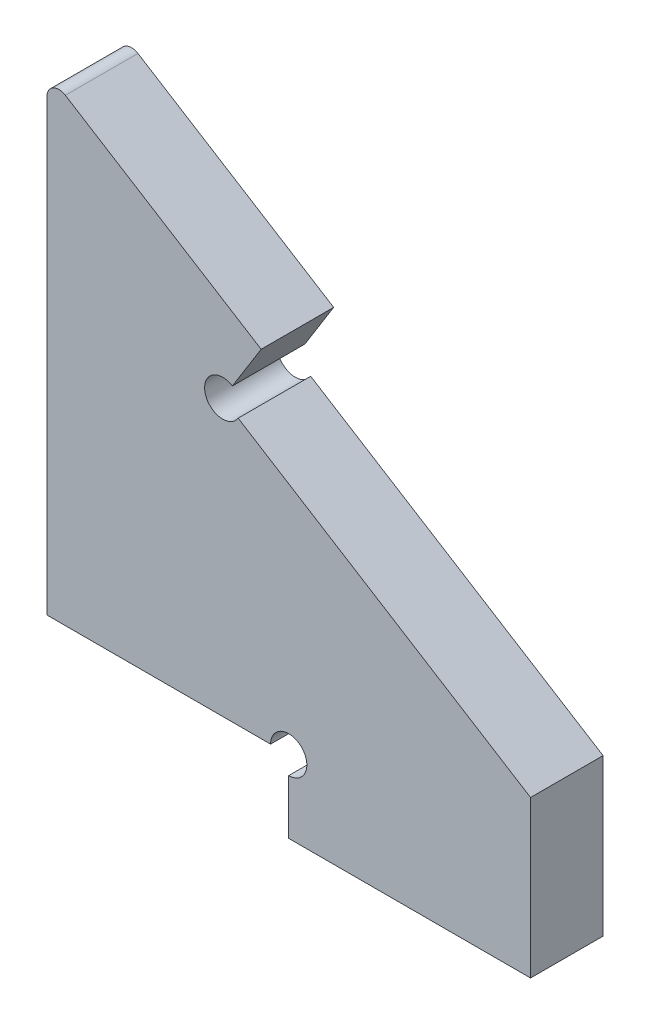
ISO-10303-21;
HEADER;
FILE_DESCRIPTION(('STEP AP214'),'2;1');
FILE_NAME('part.step','',(''),(''),'','','');
FILE_SCHEMA(('AUTOMOTIVE_DESIGN { 1 0 10303 214 1 1 1 1 }'));
ENDSEC;
DATA;
#1=APPLICATION_CONTEXT('core data for automotive mechanical design processes');
#2=APPLICATION_PROTOCOL_DEFINITION('international standard','automotive_design',2000,#1);
#3=PRODUCT_CONTEXT('',#1,'mechanical');
#4=PRODUCT('Part','Part','',(#3));
#5=PRODUCT_RELATED_PRODUCT_CATEGORY('part','',(#4));
#6=PRODUCT_DEFINITION_FORMATION('','',#4);
#7=PRODUCT_DEFINITION_CONTEXT('part definition',#1,'design');
#8=PRODUCT_DEFINITION('design','',#6,#7);
#9=PRODUCT_DEFINITION_SHAPE('','',#8);
#10=(LENGTH_UNIT() NAMED_UNIT(*) SI_UNIT(.MILLI.,.METRE.));
#11=(NAMED_UNIT(*) PLANE_ANGLE_UNIT() SI_UNIT($,.RADIAN.));
#12=(NAMED_UNIT(*) SI_UNIT($,.STERADIAN.) SOLID_ANGLE_UNIT());
#13=UNCERTAINTY_MEASURE_WITH_UNIT(LENGTH_MEASURE(1.E-05),#10,'distance_accuracy_value','');
#14=(GEOMETRIC_REPRESENTATION_CONTEXT(3) GLOBAL_UNCERTAINTY_ASSIGNED_CONTEXT((#13)) GLOBAL_UNIT_ASSIGNED_CONTEXT((#10,
#11,#12)) REPRESENTATION_CONTEXT('',''));
#15=CARTESIAN_POINT('',(0.,0.,0.));
#16=DIRECTION('',(0.,0.,1.));
#17=DIRECTION('',(1.,0.,0.));
#18=AXIS2_PLACEMENT_3D('',#15,#16,#17);
#19=CARTESIAN_POINT('',(0.,0.,3.));
#20=DIRECTION('',(0.,0.,-1.));
#21=DIRECTION('',(-1.,0.,0.));
#22=AXIS2_PLACEMENT_3D('',#19,#20,#21);
#23=PLANE('',#22);
#24=CARTESIAN_POINT('',(685.543302809506,148.802308976263,3.));
#25=DIRECTION('',(0.,0.,1.));
#26=DIRECTION('',(1.,0.,0.));
#27=AXIS2_PLACEMENT_3D('',#24,#25,#26);
#28=CIRCLE('',#27,1.49999999999995);
#29=CARTESIAN_POINT('',(686.816137669031,148.008651984623,3.));
#30=VERTEX_POINT('',#29);
#31=CARTESIAN_POINT('',(686.336959801146,150.075143835787,3.));
#32=VERTEX_POINT('',#31);
#33=EDGE_CURVE('E19',#30,#32,#28,.F.);
#34=ORIENTED_EDGE('',*,*,#33,.T.);
#35=DIRECTION('',(-0.529104661093235,-0.848556573016445,0.));
#36=VECTOR('',#35,1.);
#37=CARTESIAN_POINT('',(688.717930776066,153.893648414362,3.));
#38=LINE('',#37,#36);
#39=CARTESIAN_POINT('',(688.717930776066,153.893648414362,3.));
#40=VERTEX_POINT('',#39);
#41=EDGE_CURVE('E123',#32,#40,#38,.F.);
#42=ORIENTED_EDGE('',*,*,#41,.T.);
#43=DIRECTION('',(0.848556573016445,-0.529104661093235,0.));
#44=VECTOR('',#43,1.);
#45=CARTESIAN_POINT('',(261.90222215751,420.028150272158,3.));
#46=LINE('',#45,#44);
#47=CARTESIAN_POINT('',(672.529104661093,163.987946929558,3.));
#48=VERTEX_POINT('',#47);
#49=EDGE_CURVE('E128',#40,#48,#46,.F.);
#50=ORIENTED_EDGE('',*,*,#49,.T.);
#51=CARTESIAN_POINT('',(672.,163.139390356542,3.));
#52=DIRECTION('',(0.,0.,-1.));
#53=DIRECTION('',(0.,1.,0.));
#54=AXIS2_PLACEMENT_3D('',#51,#52,#53);
#55=CIRCLE('',#54,1.);
#56=CARTESIAN_POINT('',(671.,163.139390356542,3.));
#57=VERTEX_POINT('',#56);
#58=EDGE_CURVE('E172',#57,#48,#55,.T.);
#59=ORIENTED_EDGE('',*,*,#58,.F.);
#60=DIRECTION('',(0.,1.,0.));
#61=VECTOR('',#60,1.);
#62=CARTESIAN_POINT('',(671.,196.527564352098,3.));
#63=LINE('',#62,#61);
#64=CARTESIAN_POINT('',(671.,126.,3.));
#65=VERTEX_POINT('',#64);
#66=EDGE_CURVE('E134',#57,#65,#63,.F.);
#67=ORIENTED_EDGE('',*,*,#66,.T.);
#68=DIRECTION('',(1.,0.,0.));
#69=VECTOR('',#68,1.);
#70=CARTESIAN_POINT('',(0.,126.,3.));
#71=LINE('',#70,#69);
#72=CARTESIAN_POINT('',(689.5,126.,3.));
#73=VERTEX_POINT('',#72);
#74=EDGE_CURVE('E141',#65,#73,#71,.T.);
#75=ORIENTED_EDGE('',*,*,#74,.T.);
#76=CARTESIAN_POINT('',(691.,126.,3.));
#77=DIRECTION('',(0.,0.,1.));
#78=DIRECTION('',(1.,0.,0.));
#79=AXIS2_PLACEMENT_3D('',#76,#77,#78);
#80=CIRCLE('',#79,1.49999999999995);
#81=CARTESIAN_POINT('',(691.,124.5,3.));
#82=VERTEX_POINT('',#81);
#83=EDGE_CURVE('E144',#73,#82,#80,.F.);
#84=ORIENTED_EDGE('',*,*,#83,.T.);
#85=DIRECTION('',(0.,1.,0.));
#86=VECTOR('',#85,1.);
#87=CARTESIAN_POINT('',(691.,126.,3.));
#88=LINE('',#87,#86);
#89=CARTESIAN_POINT('',(691.,120.,3.));
#90=VERTEX_POINT('',#89);
#91=EDGE_CURVE('E147',#90,#82,#88,.T.);
#92=ORIENTED_EDGE('',*,*,#91,.F.);
#93=DIRECTION('',(1.,0.,0.));
#94=VECTOR('',#93,1.);
#95=CARTESIAN_POINT('',(691.,120.,3.));
#96=LINE('',#95,#94);
#97=CARTESIAN_POINT('',(711.,120.,3.));
#98=VERTEX_POINT('',#97);
#99=EDGE_CURVE('E154',#98,#90,#96,.F.);
#100=ORIENTED_EDGE('',*,*,#99,.F.);
#101=DIRECTION('',(0.,1.,0.));
#102=VECTOR('',#101,1.);
#103=CARTESIAN_POINT('',(711.,126.,3.));
#104=LINE('',#103,#102);
#105=CARTESIAN_POINT('',(711.,132.929169143466,3.));
#106=VERTEX_POINT('',#105);
#107=EDGE_CURVE('E101',#106,#98,#104,.F.);
#108=ORIENTED_EDGE('',*,*,#107,.F.);
#109=DIRECTION('',(0.848556573016444,-0.529104661093236,0.));
#110=VECTOR('',#109,1.);
#111=CARTESIAN_POINT('',(685.543302809506,148.802308976263,3.));
#112=LINE('',#111,#110);
#113=EDGE_CURVE('E96',#106,#30,#112,.F.);
#114=ORIENTED_EDGE('',*,*,#113,.T.);
#115=EDGE_LOOP('',(#34,#42,#50,#59,#67,#75,#84,#92,#100,#108,#114));
#116=FACE_BOUND('',#115,.T.);
#117=ADVANCED_FACE('F16',(#116),#23,.F.);
#118=CARTESIAN_POINT('',(685.543302809506,148.802308976263,-3.));
#119=DIRECTION('',(0.,0.,1.));
#120=DIRECTION('',(1.,0.,0.));
#121=AXIS2_PLACEMENT_3D('',#118,#119,#120);
#122=CYLINDRICAL_SURFACE('',#121,1.49999999999995);
#123=DIRECTION('',(0.,0.,1.));
#124=VECTOR('',#123,1.);
#125=CARTESIAN_POINT('',(686.336959801146,150.075143835788,-3.));
#126=LINE('',#125,#124);
#127=CARTESIAN_POINT('',(686.336959801146,150.075143835787,-3.));
#128=VERTEX_POINT('',#127);
#129=EDGE_CURVE('E111',#128,#32,#126,.T.);
#130=ORIENTED_EDGE('',*,*,#129,.T.);
#131=ORIENTED_EDGE('',*,*,#33,.F.);
#132=DIRECTION('',(0.,0.,1.));
#133=VECTOR('',#132,1.);
#134=CARTESIAN_POINT('',(686.816137669031,148.008651984623,-3.));
#135=LINE('',#134,#133);
#136=CARTESIAN_POINT('',(686.816137669031,148.008651984623,-3.));
#137=VERTEX_POINT('',#136);
#138=EDGE_CURVE('E105',#30,#137,#135,.F.);
#139=ORIENTED_EDGE('',*,*,#138,.T.);
#140=CARTESIAN_POINT('',(685.543302809506,148.802308976263,-3.));
#141=DIRECTION('',(0.,0.,1.));
#142=DIRECTION('',(1.,0.,0.));
#143=AXIS2_PLACEMENT_3D('',#140,#141,#142);
#144=CIRCLE('',#143,1.49999999999995);
#145=EDGE_CURVE('E125',#128,#137,#144,.T.);
#146=ORIENTED_EDGE('',*,*,#145,.F.);
#147=EDGE_LOOP('',(#130,#131,#139,#146));
#148=FACE_BOUND('',#147,.T.);
#149=ADVANCED_FACE('F108',(#148),#122,.F.);
#150=CARTESIAN_POINT('',(685.543302809506,148.802308976263,-3.));
#151=DIRECTION('',(-0.529104661093236,-0.848556573016444,0.));
#152=DIRECTION('',(0.848556573016444,-0.529104661093236,0.));
#153=AXIS2_PLACEMENT_3D('',#150,#151,#152);
#154=PLANE('',#153);
#155=ORIENTED_EDGE('',*,*,#138,.F.);
#156=ORIENTED_EDGE('',*,*,#113,.F.);
#157=DIRECTION('',(0.,0.,-1.));
#158=VECTOR('',#157,1.);
#159=CARTESIAN_POINT('',(711.,132.929169143466,3.));
#160=LINE('',#159,#158);
#161=CARTESIAN_POINT('',(711.,132.929169143466,-3.));
#162=VERTEX_POINT('',#161);
#163=EDGE_CURVE('E117',#162,#106,#160,.F.);
#164=ORIENTED_EDGE('',*,*,#163,.F.);
#165=DIRECTION('',(0.848556573016445,-0.529104661093235,0.));
#166=VECTOR('',#165,1.);
#167=CARTESIAN_POINT('',(686.816137669031,148.008651984623,-3.));
#168=LINE('',#167,#166);
#169=EDGE_CURVE('E115',#137,#162,#168,.T.);
#170=ORIENTED_EDGE('',*,*,#169,.F.);
#171=EDGE_LOOP('',(#155,#156,#164,#170));
#172=FACE_BOUND('',#171,.T.);
#173=ADVANCED_FACE('F113',(#172),#154,.F.);
#174=CARTESIAN_POINT('',(711.,126.,3.));
#175=DIRECTION('',(1.,0.,0.));
#176=DIRECTION('',(0.,0.,-1.));
#177=AXIS2_PLACEMENT_3D('',#174,#175,#176);
#178=PLANE('',#177);
#179=DIRECTION('',(0.,0.,-1.));
#180=VECTOR('',#179,1.);
#181=CARTESIAN_POINT('',(711.,120.,3.));
#182=LINE('',#181,#180);
#183=CARTESIAN_POINT('',(711.,120.,-3.));
#184=VERTEX_POINT('',#183);
#185=EDGE_CURVE('E156',#184,#98,#182,.F.);
#186=ORIENTED_EDGE('',*,*,#185,.F.);
#187=DIRECTION('',(0.,1.,0.));
#188=VECTOR('',#187,1.);
#189=CARTESIAN_POINT('',(711.,0.,-3.));
#190=LINE('',#189,#188);
#191=EDGE_CURVE('E190',#162,#184,#190,.F.);
#192=ORIENTED_EDGE('',*,*,#191,.F.);
#193=ORIENTED_EDGE('',*,*,#163,.T.);
#194=ORIENTED_EDGE('',*,*,#107,.T.);
#195=EDGE_LOOP('',(#186,#192,#193,#194));
#196=FACE_BOUND('',#195,.T.);
#197=ADVANCED_FACE('F243',(#196),#178,.T.);
#198=CARTESIAN_POINT('',(691.,120.,3.));
#199=DIRECTION('',(0.,-1.,0.));
#200=DIRECTION('',(0.,0.,-1.));
#201=AXIS2_PLACEMENT_3D('',#198,#199,#200);
#202=PLANE('',#201);
#203=ORIENTED_EDGE('',*,*,#99,.T.);
#204=DIRECTION('',(0.,0.,1.));
#205=VECTOR('',#204,1.);
#206=CARTESIAN_POINT('',(691.,120.,3.));
#207=LINE('',#206,#205);
#208=CARTESIAN_POINT('',(691.,120.,-3.));
#209=VERTEX_POINT('',#208);
#210=EDGE_CURVE('E151',#209,#90,#207,.T.);
#211=ORIENTED_EDGE('',*,*,#210,.F.);
#212=DIRECTION('',(-1.,0.,0.));
#213=VECTOR('',#212,1.);
#214=CARTESIAN_POINT('',(0.,120.,-3.));
#215=LINE('',#214,#213);
#216=EDGE_CURVE('E187',#184,#209,#215,.T.);
#217=ORIENTED_EDGE('',*,*,#216,.F.);
#218=ORIENTED_EDGE('',*,*,#185,.T.);
#219=EDGE_LOOP('',(#203,#211,#217,#218));
#220=FACE_BOUND('',#219,.T.);
#221=ADVANCED_FACE('F241',(#220),#202,.T.);
#222=CARTESIAN_POINT('',(691.,126.,3.));
#223=DIRECTION('',(-1.,0.,0.));
#224=DIRECTION('',(0.,0.,1.));
#225=AXIS2_PLACEMENT_3D('',#222,#223,#224);
#226=PLANE('',#225);
#227=ORIENTED_EDGE('',*,*,#210,.T.);
#228=ORIENTED_EDGE('',*,*,#91,.T.);
#229=DIRECTION('',(0.,0.,1.));
#230=VECTOR('',#229,1.);
#231=CARTESIAN_POINT('',(691.,124.5,-3.));
#232=LINE('',#231,#230);
#233=CARTESIAN_POINT('',(691.,124.5,-3.));
#234=VERTEX_POINT('',#233);
#235=EDGE_CURVE('E150',#82,#234,#232,.F.);
#236=ORIENTED_EDGE('',*,*,#235,.T.);
#237=DIRECTION('',(0.,1.,0.));
#238=VECTOR('',#237,1.);
#239=CARTESIAN_POINT('',(691.,0.,-3.));
#240=LINE('',#239,#238);
#241=EDGE_CURVE('E170',#209,#234,#240,.T.);
#242=ORIENTED_EDGE('',*,*,#241,.F.);
#243=EDGE_LOOP('',(#227,#228,#236,#242));
#244=FACE_BOUND('',#243,.T.);
#245=ADVANCED_FACE('F239',(#244),#226,.T.);
#246=CARTESIAN_POINT('',(691.,126.,-3.));
#247=DIRECTION('',(0.,0.,1.));
#248=DIRECTION('',(1.,0.,0.));
#249=AXIS2_PLACEMENT_3D('',#246,#247,#248);
#250=CYLINDRICAL_SURFACE('',#249,1.49999999999995);
#251=DIRECTION('',(0.,0.,1.));
#252=VECTOR('',#251,1.);
#253=CARTESIAN_POINT('',(689.5,126.,0.));
#254=LINE('',#253,#252);
#255=CARTESIAN_POINT('',(689.5,126.,-3.));
#256=VERTEX_POINT('',#255);
#257=EDGE_CURVE('E143',#73,#256,#254,.F.);
#258=ORIENTED_EDGE('',*,*,#257,.T.);
#259=CARTESIAN_POINT('',(691.,126.,-3.));
#260=DIRECTION('',(0.,0.,1.));
#261=DIRECTION('',(1.,0.,0.));
#262=AXIS2_PLACEMENT_3D('',#259,#260,#261);
#263=CIRCLE('',#262,1.49999999999995);
#264=EDGE_CURVE('E167',#234,#256,#263,.T.);
#265=ORIENTED_EDGE('',*,*,#264,.F.);
#266=ORIENTED_EDGE('',*,*,#235,.F.);
#267=ORIENTED_EDGE('',*,*,#83,.F.);
#268=EDGE_LOOP('',(#258,#265,#266,#267));
#269=FACE_BOUND('',#268,.T.);
#270=ADVANCED_FACE('F225',(#269),#250,.F.);
#271=CARTESIAN_POINT('',(0.,126.,0.));
#272=DIRECTION('',(0.,1.,0.));
#273=DIRECTION('',(0.,0.,1.));
#274=AXIS2_PLACEMENT_3D('',#271,#272,#273);
#275=PLANE('',#274);
#276=ORIENTED_EDGE('',*,*,#257,.F.);
#277=ORIENTED_EDGE('',*,*,#74,.F.);
#278=DIRECTION('',(0.,0.,-1.));
#279=VECTOR('',#278,1.);
#280=CARTESIAN_POINT('',(671.,126.,-3.));
#281=LINE('',#280,#279);
#282=CARTESIAN_POINT('',(671.,126.,-3.));
#283=VERTEX_POINT('',#282);
#284=EDGE_CURVE('E138',#65,#283,#281,.T.);
#285=ORIENTED_EDGE('',*,*,#284,.T.);
#286=DIRECTION('',(-1.,0.,0.));
#287=VECTOR('',#286,1.);
#288=CARTESIAN_POINT('',(0.,126.,-3.));
#289=LINE('',#288,#287);
#290=EDGE_CURVE('E169',#256,#283,#289,.T.);
#291=ORIENTED_EDGE('',*,*,#290,.F.);
#292=EDGE_LOOP('',(#276,#277,#285,#291));
#293=FACE_BOUND('',#292,.T.);
#294=ADVANCED_FACE('F228',(#293),#275,.F.);
#295=CARTESIAN_POINT('',(671.,196.527564352098,-3.));
#296=DIRECTION('',(1.,0.,0.));
#297=DIRECTION('',(0.,0.,-1.));
#298=AXIS2_PLACEMENT_3D('',#295,#296,#297);
#299=PLANE('',#298);
#300=DIRECTION('',(0.,0.,-1.));
#301=VECTOR('',#300,1.);
#302=CARTESIAN_POINT('',(671.,163.139390356542,-3.));
#303=LINE('',#302,#301);
#304=CARTESIAN_POINT('',(671.,163.139390356542,-3.));
#305=VERTEX_POINT('',#304);
#306=EDGE_CURVE('E137',#305,#57,#303,.F.);
#307=ORIENTED_EDGE('',*,*,#306,.F.);
#308=DIRECTION('',(0.,1.,0.));
#309=VECTOR('',#308,1.);
#310=CARTESIAN_POINT('',(671.,0.,-3.));
#311=LINE('',#310,#309);
#312=EDGE_CURVE('E166',#283,#305,#311,.T.);
#313=ORIENTED_EDGE('',*,*,#312,.F.);
#314=ORIENTED_EDGE('',*,*,#284,.F.);
#315=ORIENTED_EDGE('',*,*,#66,.F.);
#316=EDGE_LOOP('',(#307,#313,#314,#315));
#317=FACE_BOUND('',#316,.T.);
#318=ADVANCED_FACE('F268',(#317),#299,.F.);
#319=CARTESIAN_POINT('',(672.,163.139390356542,-3.));
#320=DIRECTION('',(0.,0.,-1.));
#321=DIRECTION('',(0.,1.,0.));
#322=AXIS2_PLACEMENT_3D('',#319,#320,#321);
#323=CYLINDRICAL_SURFACE('',#322,1.);
#324=DIRECTION('',(0.,0.,1.));
#325=VECTOR('',#324,1.);
#326=CARTESIAN_POINT('',(672.529104661093,163.987946929558,347.5));
#327=LINE('',#326,#325);
#328=CARTESIAN_POINT('',(672.529104661093,163.987946929558,-3.));
#329=VERTEX_POINT('',#328);
#330=EDGE_CURVE('E131',#48,#329,#327,.F.);
#331=ORIENTED_EDGE('',*,*,#330,.T.);
#332=CARTESIAN_POINT('',(672.,163.139390356542,-3.));
#333=DIRECTION('',(0.,0.,-1.));
#334=DIRECTION('',(0.,1.,0.));
#335=AXIS2_PLACEMENT_3D('',#332,#333,#334);
#336=CIRCLE('',#335,1.);
#337=EDGE_CURVE('E164',#305,#329,#336,.T.);
#338=ORIENTED_EDGE('',*,*,#337,.F.);
#339=ORIENTED_EDGE('',*,*,#306,.T.);
#340=ORIENTED_EDGE('',*,*,#58,.T.);
#341=EDGE_LOOP('',(#331,#338,#339,#340));
#342=FACE_BOUND('',#341,.T.);
#343=ADVANCED_FACE('F265',(#342),#323,.T.);
#344=CARTESIAN_POINT('',(261.90222215751,420.028150272158,347.5));
#345=DIRECTION('',(-0.529104661093235,-0.848556573016445,0.));
#346=DIRECTION('',(0.848556573016445,-0.529104661093235,0.));
#347=AXIS2_PLACEMENT_3D('',#344,#345,#346);
#348=PLANE('',#347);
#349=DIRECTION('',(0.,0.,1.));
#350=VECTOR('',#349,1.);
#351=CARTESIAN_POINT('',(688.717930776066,153.893648414362,-3.));
#352=LINE('',#351,#350);
#353=CARTESIAN_POINT('',(688.717930776066,153.893648414362,-3.));
#354=VERTEX_POINT('',#353);
#355=EDGE_CURVE('E34',#40,#354,#352,.F.);
#356=ORIENTED_EDGE('',*,*,#355,.T.);
#357=DIRECTION('',(0.848556573016445,-0.529104661093235,0.));
#358=VECTOR('',#357,1.);
#359=CARTESIAN_POINT('',(672.529104661093,163.987946929558,-3.));
#360=LINE('',#359,#358);
#361=EDGE_CURVE('E25',#329,#354,#360,.T.);
#362=ORIENTED_EDGE('',*,*,#361,.F.);
#363=ORIENTED_EDGE('',*,*,#330,.F.);
#364=ORIENTED_EDGE('',*,*,#49,.F.);
#365=EDGE_LOOP('',(#356,#362,#363,#364));
#366=FACE_BOUND('',#365,.T.);
#367=ADVANCED_FACE('F259',(#366),#348,.F.);
#368=CARTESIAN_POINT('',(688.717930776066,153.893648414362,-3.));
#369=DIRECTION('',(-0.848556573016445,0.529104661093235,0.));
#370=DIRECTION('',(-0.529104661093235,-0.848556573016445,0.));
#371=AXIS2_PLACEMENT_3D('',#368,#369,#370);
#372=PLANE('',#371);
#373=ORIENTED_EDGE('',*,*,#129,.F.);
#374=DIRECTION('',(-0.529104661093241,-0.848556573016441,0.));
#375=VECTOR('',#374,1.);
#376=CARTESIAN_POINT('',(688.717930776066,153.893648414362,-3.));
#377=LINE('',#376,#375);
#378=EDGE_CURVE('E11',#354,#128,#377,.T.);
#379=ORIENTED_EDGE('',*,*,#378,.F.);
#380=ORIENTED_EDGE('',*,*,#355,.F.);
#381=ORIENTED_EDGE('',*,*,#41,.F.);
#382=EDGE_LOOP('',(#373,#379,#380,#381));
#383=FACE_BOUND('',#382,.T.);
#384=ADVANCED_FACE('F254',(#383),#372,.F.);
#385=CARTESIAN_POINT('',(0.,0.,-3.));
#386=DIRECTION('',(0.,0.,-1.));
#387=DIRECTION('',(-1.,0.,0.));
#388=AXIS2_PLACEMENT_3D('',#385,#386,#387);
#389=PLANE('',#388);
#390=ORIENTED_EDGE('',*,*,#361,.T.);
#391=ORIENTED_EDGE('',*,*,#378,.T.);
#392=ORIENTED_EDGE('',*,*,#145,.T.);
#393=ORIENTED_EDGE('',*,*,#169,.T.);
#394=ORIENTED_EDGE('',*,*,#191,.T.);
#395=ORIENTED_EDGE('',*,*,#216,.T.);
#396=ORIENTED_EDGE('',*,*,#241,.T.);
#397=ORIENTED_EDGE('',*,*,#264,.T.);
#398=ORIENTED_EDGE('',*,*,#290,.T.);
#399=ORIENTED_EDGE('',*,*,#312,.T.);
#400=ORIENTED_EDGE('',*,*,#337,.T.);
#401=EDGE_LOOP('',(#390,#391,#392,#393,#394,#395,#396,#397,#398,#399,#400));
#402=FACE_BOUND('',#401,.T.);
#403=ADVANCED_FACE('F237',(#402),#389,.T.);
#404=CLOSED_SHELL('',(#117,#149,#173,#197,#221,#245,#270,#294,#318,#343,#367,#384,#403));
#405=MANIFOLD_SOLID_BREP('B1',#404);
#406=ADVANCED_BREP_SHAPE_REPRESENTATION('',(#18,#405),#14);
#407=SHAPE_DEFINITION_REPRESENTATION(#9,#406);
ENDSEC;
END-ISO-10303-21;
